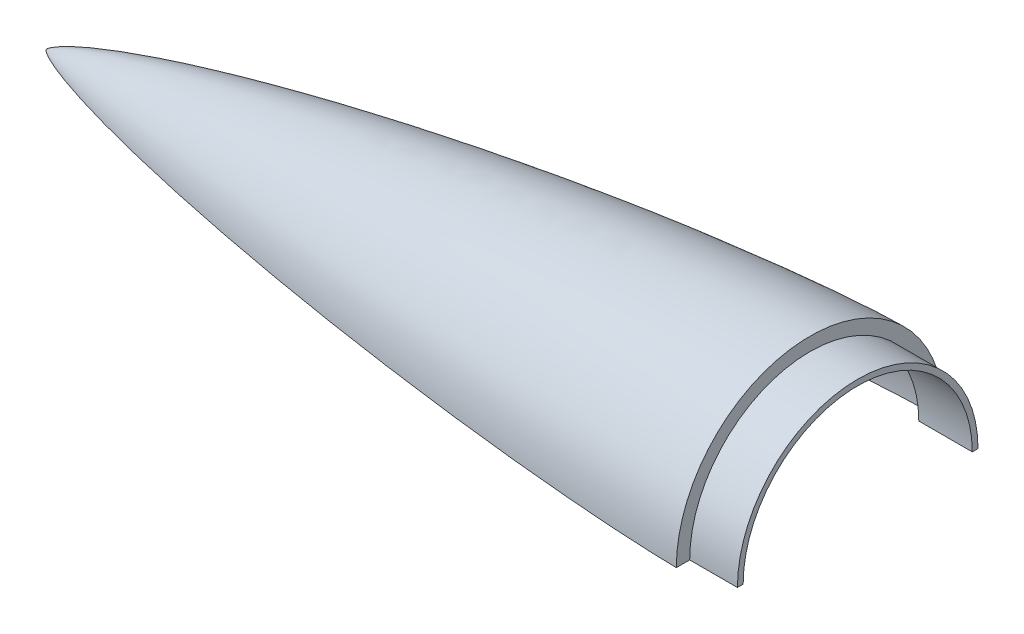
ISO-10303-21;
HEADER;
FILE_DESCRIPTION(('STEP AP214'),'2;1');
FILE_NAME('part.step','',(''),(''),'','','');
FILE_SCHEMA(('AUTOMOTIVE_DESIGN { 1 0 10303 214 1 1 1 1 }'));
ENDSEC;
DATA;
#1=APPLICATION_CONTEXT('core data for automotive mechanical design processes');
#2=APPLICATION_PROTOCOL_DEFINITION('international standard','automotive_design',2000,#1);
#3=PRODUCT_CONTEXT('',#1,'mechanical');
#4=PRODUCT('Part','Part','',(#3));
#5=PRODUCT_RELATED_PRODUCT_CATEGORY('part','',(#4));
#6=PRODUCT_DEFINITION_FORMATION('','',#4);
#7=PRODUCT_DEFINITION_CONTEXT('part definition',#1,'design');
#8=PRODUCT_DEFINITION('design','',#6,#7);
#9=PRODUCT_DEFINITION_SHAPE('','',#8);
#10=(LENGTH_UNIT() NAMED_UNIT(*) SI_UNIT(.MILLI.,.METRE.));
#11=(NAMED_UNIT(*) PLANE_ANGLE_UNIT() SI_UNIT($,.RADIAN.));
#12=(NAMED_UNIT(*) SI_UNIT($,.STERADIAN.) SOLID_ANGLE_UNIT());
#13=UNCERTAINTY_MEASURE_WITH_UNIT(LENGTH_MEASURE(1.E-05),#10,'distance_accuracy_value','');
#14=(GEOMETRIC_REPRESENTATION_CONTEXT(3) GLOBAL_UNCERTAINTY_ASSIGNED_CONTEXT((#13)) GLOBAL_UNIT_ASSIGNED_CONTEXT((#10,
#11,#12)) REPRESENTATION_CONTEXT('',''));
#15=CARTESIAN_POINT('',(0.,0.,0.));
#16=DIRECTION('',(0.,0.,1.));
#17=DIRECTION('',(1.,0.,0.));
#18=AXIS2_PLACEMENT_3D('',#15,#16,#17);
#19=CARTESIAN_POINT('',(0.,70.,0.));
#20=CARTESIAN_POINT('',(-1.16949961670868,69.995226326646,0.));
#21=CARTESIAN_POINT('',(-3.50827222437997,69.9582954923376,0.));
#22=CARTESIAN_POINT('',(-8.18492205701203,69.8427964931094,0.));
#23=CARTESIAN_POINT('',(-16.0647203077819,69.549683559367,0.));
#24=CARTESIAN_POINT('',(-25.9754545930025,69.0595655701343,0.));
#25=CARTESIAN_POINT('',(-41.1142995028447,68.1271885508895,0.));
#26=CARTESIAN_POINT('',(-60.3019712314636,66.6694611339765,0.));
#27=CARTESIAN_POINT('',(-82.6608105445907,64.6462274703062,0.));
#28=CARTESIAN_POINT('',(-108.176862675185,61.9592577213872,0.));
#29=CARTESIAN_POINT('',(-133.65506783508,58.9354318392771,0.));
#30=CARTESIAN_POINT('',(-159.093639283262,55.5950064524379,0.));
#31=CARTESIAN_POINT('',(-184.489927467141,51.9470200091218,0.));
#32=CARTESIAN_POINT('',(-209.840012518461,47.9907031560732,0.));
#33=CARTESIAN_POINT('',(-235.138543241406,43.7164840508938,0.));
#34=CARTESIAN_POINT('',(-260.377558213754,39.1034775288672,0.));
#35=CARTESIAN_POINT('',(-285.545859987468,34.1174005343544,0.));
#36=CARTESIAN_POINT('',(-310.625181375792,28.7002406264691,0.));
#37=CARTESIAN_POINT('',(-334.934852920424,22.9127414793634,0.));
#38=CARTESIAN_POINT('',(-355.97958419344,17.2897213562296,0.));
#39=CARTESIAN_POINT('',(-372.609649156935,12.2240751306481,0.));
#40=CARTESIAN_POINT('',(-384.103449660705,8.1599724038953,0.));
#41=CARTESIAN_POINT('',(-390.688387139325,5.4785191176599,0.));
#42=CARTESIAN_POINT('',(-394.221613408312,3.82269658501143,0.));
#43=CARTESIAN_POINT('',(-395.891479604764,2.94449609927367,0.));
#44=CARTESIAN_POINT('',(-396.471951593647,2.62151059680884,0.));
#45=B_SPLINE_CURVE_WITH_KNOTS('',4,(#19,#20,#21,#22,#23,#24,#25,#26,#27,#28,#29,#30,#31,#32,#33,
#34,#35,#36,#37,#38,#39,#40,#41,#42,#43,#44),.UNSPECIFIED.,.F.,.F.,(5,1,1,1,1,1,1,1,1,1,1,1,1,1,
1,1,1,1,1,1,1,1,5),(0.,0.0114632217312616,0.0229264434625231,0.0458528869250464,
0.0772877161212603,0.108722545317474,0.171592202654285,0.234461860835688,0.297331518792184,
0.360201174766281,0.423070831964841,0.485940492320326,0.548810146845117,0.611679804413118,
0.674549462980742,0.737419118438164,0.80028877075292,0.863158423951068,0.919463856187153,
0.950898668789713,0.970639035853759,0.98261611051617,0.989127343574552),.UNSPECIFIED.);
#46=CARTESIAN_POINT('',(-130.27278513866,0.,0.));
#47=DIRECTION('',(-1.,0.,0.));
#48=AXIS1_PLACEMENT('',#46,#47);
#49=SURFACE_OF_REVOLUTION('',#45,#48);
#50=OFFSET_SURFACE('',#49,-3.,.F.);
#51=CARTESIAN_POINT('',(-2.99999999999995,0.,66.9610434179468));
#52=CARTESIAN_POINT('',(-3.43888252484056,0.,66.952396026765));
#53=CARTESIAN_POINT('',(-3.87774772743526,0.,66.9429152196826));
#54=CARTESIAN_POINT('',(-4.75544268555462,0.,66.9224717190605));
#55=CARTESIAN_POINT('',(-5.19427244116037,0.,66.9115090290128));
#56=CARTESIAN_POINT('',(-6.51070158714471,0.,66.8766757176007));
#57=CARTESIAN_POINT('',(-7.38824970696645,0.,66.8508596731302));
#58=CARTESIAN_POINT('',(-9.14317888312383,0.,66.7948530243619));
#59=CARTESIAN_POINT('',(-10.0205599435967,0.,66.764662548097));
#60=CARTESIAN_POINT('',(-11.7751843774068,0.,66.7004628596125));
#61=CARTESIAN_POINT('',(-12.6524277503328,0.,66.6664536362003));
#62=CARTESIAN_POINT('',(-14.4064412794081,0.,66.5950682549035));
#63=CARTESIAN_POINT('',(-15.2832114882988,0.,66.5576933884347));
#64=CARTESIAN_POINT('',(-17.0366171320548,0.,66.4798996444132));
#65=CARTESIAN_POINT('',(-17.91325256679,0.,66.4394807639409));
#66=CARTESIAN_POINT('',(-20.5429708591908,0.,66.3139939412977));
#67=CARTESIAN_POINT('',(-22.2958530222071,0.,66.224696341354));
#68=CARTESIAN_POINT('',(-25.8008087555287,0.,66.0361401333468));
#69=CARTESIAN_POINT('',(-27.5528824085103,0.,65.9368830512253));
#70=CARTESIAN_POINT('',(-31.0564920504161,0.,65.7294122967442));
#71=CARTESIAN_POINT('',(-32.8080280412117,0.,65.6211986559247));
#72=CARTESIAN_POINT('',(-36.3104692811736,0.,65.3965704588788));
#73=CARTESIAN_POINT('',(-38.0613745614821,0.,65.280156387379));
#74=CARTESIAN_POINT('',(-41.5626631360219,0.,65.0397241907689));
#75=CARTESIAN_POINT('',(-43.3130464297218,0.,64.9157060579465));
#76=CARTESIAN_POINT('',(-48.5633498636771,0.,64.5329465634494));
#77=CARTESIAN_POINT('',(-52.062493241626,0.,64.2634955968156));
#78=CARTESIAN_POINT('',(-59.0587124582703,0.,63.6989380205588));
#79=CARTESIAN_POINT('',(-62.5557882886054,0.,63.4038313079005));
#80=CARTESIAN_POINT('',(-69.5474278512472,0.,62.7901579257159));
#81=CARTESIAN_POINT('',(-73.0419918475409,0.,62.4715942600364));
#82=CARTESIAN_POINT('',(-80.0292014442456,0.,61.8124786661117));
#83=CARTESIAN_POINT('',(-83.5218469510094,0.,61.471925746651));
#84=CARTESIAN_POINT('',(-90.5051906002409,0.,60.7700692376057));
#85=CARTESIAN_POINT('',(-93.9958886597688,0.,60.4087648235955));
#86=CARTESIAN_POINT('',(-100.975277186049,0.,59.6663561318406));
#87=CARTESIAN_POINT('',(-104.463967592976,0.,59.2852512921232));
#88=CARTESIAN_POINT('',(-111.439259958038,0.,58.5039965620865));
#89=CARTESIAN_POINT('',(-114.925861888631,0.,58.1038464259734));
#90=CARTESIAN_POINT('',(-121.896877308012,0.,57.2850921488217));
#91=CARTESIAN_POINT('',(-125.381290808534,0.,56.8664881076055));
#92=CARTESIAN_POINT('',(-133.35160350187,0.,55.8880486853035));
#93=CARTESIAN_POINT('',(-137.836774569437,0.,55.3222737582015));
#94=CARTESIAN_POINT('',(-146.803196621593,0.,54.1615245006798));
#95=CARTESIAN_POINT('',(-151.284447720027,0.,53.5665510489967));
#96=CARTESIAN_POINT('',(-160.242960539903,0.,52.3477841562707));
#97=CARTESIAN_POINT('',(-164.720222320264,0.,51.7239911483194));
#98=CARTESIAN_POINT('',(-173.670648464039,0.,50.4477088766467));
#99=CARTESIAN_POINT('',(-178.143812832296,0.,49.7952196468939));
#100=CARTESIAN_POINT('',(-187.085901760953,0.,48.4614170614654));
#101=CARTESIAN_POINT('',(-191.554826265871,0.,47.7801033337685));
#102=CARTESIAN_POINT('',(-200.488393631915,0.,46.388276988371));
#103=CARTESIAN_POINT('',(-204.953036228632,0.,45.6777626731107));
#104=CARTESIAN_POINT('',(-213.877525431171,0.,44.2269615141551));
#105=CARTESIAN_POINT('',(-218.337371992352,0.,43.4866743957551));
#106=CARTESIAN_POINT('',(-227.251845775793,0.,41.9754372468582));
#107=CARTESIAN_POINT('',(-231.706473025376,0.,41.204487377631));
#108=CARTESIAN_POINT('',(-240.610025267542,0.,39.6307014457303));
#109=CARTESIAN_POINT('',(-245.058950343966,0.,38.8278658575635));
#110=CARTESIAN_POINT('',(-253.950565128397,0.,37.1887457715759));
#111=CARTESIAN_POINT('',(-258.393254941974,0.,36.3524618473227));
#112=CARTESIAN_POINT('',(-265.626443186711,0.,34.9608650963703));
#113=CARTESIAN_POINT('',(-268.419011566216,0.,34.4162943709353));
#114=CARTESIAN_POINT('',(-274.001234772111,0.,33.3123962678183));
#115=CARTESIAN_POINT('',(-276.790889596647,0.,32.753068880752));
#116=CARTESIAN_POINT('',(-282.367055580555,0.,31.6188913426154));
#117=CARTESIAN_POINT('',(-285.153566726497,0.,31.0440411254912));
#118=CARTESIAN_POINT('',(-290.723145394243,0.,29.8778961934534));
#119=CARTESIAN_POINT('',(-293.506212919262,0.,29.2866014939128));
#120=CARTESIAN_POINT('',(-299.068277028093,0.,28.0865716504607));
#121=CARTESIAN_POINT('',(-301.847274014593,0.,27.4778383741989));
#122=CARTESIAN_POINT('',(-307.40109684245,0.,26.2415880230597));
#123=CARTESIAN_POINT('',(-310.17592267491,0.,25.6140709081794));
#124=CARTESIAN_POINT('',(-315.720814621765,0.,24.3386069943912));
#125=CARTESIAN_POINT('',(-318.490880839405,0.,23.6906606446934));
#126=CARTESIAN_POINT('',(-324.025663961762,0.,22.3723520418509));
#127=CARTESIAN_POINT('',(-326.790380903423,0.,21.7019899441058));
#128=CARTESIAN_POINT('',(-331.402332732126,0.,20.5616416957649));
#129=CARTESIAN_POINT('',(-333.251268926056,0.,20.0985312725594));
#130=CARTESIAN_POINT('',(-336.946047160374,0.,19.1601157310499));
#131=CARTESIAN_POINT('',(-338.791889201611,0.,18.6848106160909));
#132=CARTESIAN_POINT('',(-342.480112913489,0.,17.7208506634059));
#133=CARTESIAN_POINT('',(-344.322494538301,0.,17.2321956501874));
#134=CARTESIAN_POINT('',(-348.003251924485,0.,16.2402707702587));
#135=CARTESIAN_POINT('',(-349.841627828929,0.,15.73700143504));
#136=CARTESIAN_POINT('',(-353.513835545809,0.,14.7141906600207));
#137=CARTESIAN_POINT('',(-355.347667397896,0.,14.194649362754));
#138=CARTESIAN_POINT('',(-359.009897649795,0.,13.136877143322));
#139=CARTESIAN_POINT('',(-360.838296184148,0.,12.5986466882006));
#140=CARTESIAN_POINT('',(-364.038432714351,0.,11.6357257128484));
#141=CARTESIAN_POINT('',(-365.411594177994,0.,11.2157673062214));
#142=CARTESIAN_POINT('',(-368.153556358703,0.,10.3617812753048));
#143=CARTESIAN_POINT('',(-369.522357038444,0.,9.9277535309392));
#144=CARTESIAN_POINT('',(-372.254725978953,0.,9.04375144655052));
#145=CARTESIAN_POINT('',(-373.618294514137,0.,8.59377795587572));
#146=CARTESIAN_POINT('',(-376.338975622214,0.,7.67474112906591));
#147=CARTESIAN_POINT('',(-377.696088364248,0.,7.2056782961855));
#148=CARTESIAN_POINT('',(-379.728212285434,0.,6.48335297688492));
#149=CARTESIAN_POINT('',(-380.406372376539,0.,6.23893946698225));
#150=CARTESIAN_POINT('',(-381.760250160152,0.,5.74344551370973));
#151=CARTESIAN_POINT('',(-382.435967873165,0.,5.49236512646047));
#152=CARTESIAN_POINT('',(-383.784513196503,0.,4.98263399567667));
#153=CARTESIAN_POINT('',(-384.457340932011,0.,4.72398358392042));
#154=CARTESIAN_POINT('',(-385.799488681186,0.,4.19775854188566));
#155=CARTESIAN_POINT('',(-386.46880876229,0.,3.93018408391164));
#156=CARTESIAN_POINT('',(-387.805280407321,0.,3.38348890977298));
#157=CARTESIAN_POINT('',(-388.472417822326,0.,3.10433344709527));
#158=CARTESIAN_POINT('',(-389.468931324343,0.,2.67589675733894));
#159=CARTESIAN_POINT('',(-389.800397284897,0.,2.53147019539166));
#160=CARTESIAN_POINT('',(-390.461700490882,0.,2.23892115487399));
#161=CARTESIAN_POINT('',(-390.791537723327,0.,2.090798646889));
#162=CARTESIAN_POINT('',(-391.449954194621,0.,1.78995320958661));
#163=CARTESIAN_POINT('',(-391.77852930157,0.,1.63722121924235));
#164=CARTESIAN_POINT('',(-392.433279201752,0.,1.32670687858124));
#165=CARTESIAN_POINT('',(-392.759454047249,0.,1.1689246386325));
#166=CARTESIAN_POINT('',(-393.40923140082,0.,0.847245982483843));
#167=CARTESIAN_POINT('',(-393.732830723635,0.,0.683343100044987));
#168=CARTESIAN_POINT('',(-394.215368125964,0.,0.431821638446822));
#169=CARTESIAN_POINT('',(-394.375773130283,0.,0.347016707817738));
#170=CARTESIAN_POINT('',(-394.615518987886,0.,0.218176241518998));
#171=CARTESIAN_POINT('',(-394.695296896494,0.,0.174953782752291));
#172=CARTESIAN_POINT('',(-394.814727159502,0.,0.109682962325512));
#173=CARTESIAN_POINT('',(-394.854498743022,0.,0.0878526501471235));
#174=CARTESIAN_POINT('',(-394.914094010214,0.,0.0549939620825964));
#175=CARTESIAN_POINT('',(-394.933948875154,0.,0.0440221253171899));
#176=CARTESIAN_POINT('',(-394.963715263731,0.,0.0275355728031376));
#177=CARTESIAN_POINT('',(-394.973634758439,0.,0.0220352464710054));
#178=CARTESIAN_POINT('',(-394.988509974025,0.,0.0137774943274114));
#179=CARTESIAN_POINT('',(-394.993467710273,0.,0.0110236986531012));
#180=CARTESIAN_POINT('',(-395.000903301835,0.,0.00689118161342122));
#181=CARTESIAN_POINT('',(-395.003381663823,0.,0.00551337186225007));
#182=CARTESIAN_POINT('',(-395.007098952823,0.,0.00344620035921114));
#183=CARTESIAN_POINT('',(-395.00833800686,0.,0.00275706702657534));
#184=CARTESIAN_POINT('',(-395.010196524321,0.,0.00172325268483205));
#185=CARTESIAN_POINT('',(-395.010816019546,0.,0.00137862884479298));
#186=CARTESIAN_POINT('',(-395.011745246474,0.,0.000861664483472428));
#187=CARTESIAN_POINT('',(-395.012054986132,0.,0.000689338262503399));
#188=CARTESIAN_POINT('',(-395.012669620502,0.,0.000347368955913764));
#189=CARTESIAN_POINT('',(-395.012974515296,0.,0.00017772601813296));
#190=CARTESIAN_POINT('',(-395.013279407519,0.,8.07845877562677E-06));
#191=B_SPLINE_CURVE_WITH_KNOTS('',3,(#51,#52,#53,#54,#55,#56,#57,#58,#59,#60,#61,#62,#63,#64,
#65,#66,#67,#68,#69,#70,#71,#72,#73,#74,#75,#76,#77,#78,#79,#80,#81,#82,#83,#84,#85,#86,#87,#88,
#89,#90,#91,#92,#93,#94,#95,#96,#97,#98,#99,#100,#101,#102,#103,#104,#105,#106,#107,#108,#109,
#110,#111,#112,#113,#114,#115,#116,#117,#118,#119,#120,#121,#122,#123,#124,#125,#126,#127,#128,
#129,#130,#131,#132,#133,#134,#135,#136,#137,#138,#139,#140,#141,#142,#143,#144,#145,#146,#147,
#148,#149,#150,#151,#152,#153,#154,#155,#156,#157,#158,#159,#160,#161,#162,#163,#164,#165,#166,
#167,#168,#169,#170,#171,#172,#173,#174,#175,#176,#177,#178,#179,#180,#181,#182,#183,#184,#185,
#186,#187,#188,#189,#190),.UNSPECIFIED.,.F.,.F.,(4,2,2,2,2,2,2,2,2,2,2,2,2,2,2,2,2,2,2,2,2,2,2,
2,2,2,2,2,2,2,2,2,2,2,2,2,2,2,2,2,2,2,2,2,2,2,2,2,2,2,2,2,2,2,2,2,2,2,2,2,2,2,2,2,2,2,2,2,2,4),
(0.,1.31690091484604,2.63379872655486,5.26756779400745,7.9012597907728,10.5349595070443,
13.1676529293554,15.8003488766838,21.0657788515156,26.3304033118442,31.5950092337963,
36.8593042261299,42.1236045577084,52.6519957357815,63.1804291985594,73.7075167498442,
84.2350791652274,94.763060114424,105.29134003058,115.819755858886,126.348114742897,
139.910156459711,153.471790273635,167.033220353684,180.594634381105,194.156223491354,
207.718602115291,221.281105903911,234.843538370445,248.405769083432,261.967767332698,
270.503244460704,279.038727016752,287.574245899337,296.10975680289,304.644356956558,
313.178975287168,321.713406084218,330.247777727667,335.965899897551,341.684020498954,
347.402216304723,353.120204411845,358.838142446367,364.555937691783,368.863708523306,
373.17151612955,377.479094624804,381.786559632324,383.949111155919,386.111644481305,
388.27408316891,390.436480128531,392.60591533753,393.690590548364,394.775274394467,
395.862250633135,396.94920313323,398.037338386249,398.58165351003,398.853853825482,
398.989960361939,399.058014503681,399.092041688905,399.109055296147,399.117562101618,
399.121815504586,399.123942206099,399.12500555686,399.126052292765),.UNSPECIFIED.);
#192=CARTESIAN_POINT('',(-395.01326488884,0.,1.61569106375131E-05));
#193=VERTEX_POINT('',#192);
#194=CARTESIAN_POINT('',(-3.,0.,66.9610434179468));
#195=VERTEX_POINT('',#194);
#196=EDGE_CURVE('E103',#193,#195,#191,.F.);
#197=ORIENTED_EDGE('',*,*,#196,.F.);
#198=CARTESIAN_POINT('',(-2.99999999999995,0.,-66.9610434179468));
#199=CARTESIAN_POINT('',(-3.43888252484056,0.,-66.952396026765));
#200=CARTESIAN_POINT('',(-3.87774772743526,0.,-66.9429152196826));
#201=CARTESIAN_POINT('',(-4.75544268555462,0.,-66.9224717190605));
#202=CARTESIAN_POINT('',(-5.19427244116038,0.,-66.9115090290128));
#203=CARTESIAN_POINT('',(-6.51070158714471,0.,-66.8766757176007));
#204=CARTESIAN_POINT('',(-7.38824970696645,0.,-66.8508596731302));
#205=CARTESIAN_POINT('',(-9.14317888312383,0.,-66.7948530243619));
#206=CARTESIAN_POINT('',(-10.0205599435967,0.,-66.764662548097));
#207=CARTESIAN_POINT('',(-11.7751843774068,0.,-66.7004628596125));
#208=CARTESIAN_POINT('',(-12.6524277503328,0.,-66.6664536362003));
#209=CARTESIAN_POINT('',(-14.4064412794081,0.,-66.5950682549034));
#210=CARTESIAN_POINT('',(-15.2832114882988,0.,-66.5576933884347));
#211=CARTESIAN_POINT('',(-17.0366171320548,0.,-66.4798996444132));
#212=CARTESIAN_POINT('',(-17.91325256679,0.,-66.4394807639409));
#213=CARTESIAN_POINT('',(-20.5429708591908,0.,-66.3139939412977));
#214=CARTESIAN_POINT('',(-22.2958530222072,0.,-66.224696341354));
#215=CARTESIAN_POINT('',(-25.8008087555287,0.,-66.0361401333468));
#216=CARTESIAN_POINT('',(-27.5528824085104,0.,-65.9368830512253));
#217=CARTESIAN_POINT('',(-31.0564920504161,0.,-65.7294122967441));
#218=CARTESIAN_POINT('',(-32.8080280412117,0.,-65.6211986559247));
#219=CARTESIAN_POINT('',(-36.3104692811736,0.,-65.3965704588788));
#220=CARTESIAN_POINT('',(-38.0613745614822,0.,-65.280156387379));
#221=CARTESIAN_POINT('',(-41.5626631360219,0.,-65.0397241907689));
#222=CARTESIAN_POINT('',(-43.3130464297219,0.,-64.9157060579465));
#223=CARTESIAN_POINT('',(-48.5633498636771,0.,-64.5329465634493));
#224=CARTESIAN_POINT('',(-52.0624932416261,0.,-64.2634955968156));
#225=CARTESIAN_POINT('',(-59.0587124582703,0.,-63.6989380205588));
#226=CARTESIAN_POINT('',(-62.5557882886054,0.,-63.4038313079005));
#227=CARTESIAN_POINT('',(-69.5474278512473,0.,-62.7901579257159));
#228=CARTESIAN_POINT('',(-73.041991847541,0.,-62.4715942600363));
#229=CARTESIAN_POINT('',(-80.0292014442457,0.,-61.8124786661117));
#230=CARTESIAN_POINT('',(-83.5218469510095,0.,-61.471925746651));
#231=CARTESIAN_POINT('',(-90.5051906002409,0.,-60.7700692376057));
#232=CARTESIAN_POINT('',(-93.9958886597689,0.,-60.4087648235955));
#233=CARTESIAN_POINT('',(-100.975277186049,0.,-59.6663561318406));
#234=CARTESIAN_POINT('',(-104.463967592977,0.,-59.2852512921232));
#235=CARTESIAN_POINT('',(-111.439259958038,0.,-58.5039965620865));
#236=CARTESIAN_POINT('',(-114.925861888631,0.,-58.1038464259735));
#237=CARTESIAN_POINT('',(-121.896877308012,0.,-57.2850921488217));
#238=CARTESIAN_POINT('',(-125.381290808534,0.,-56.8664881076055));
#239=CARTESIAN_POINT('',(-133.35160350187,0.,-55.8880486853035));
#240=CARTESIAN_POINT('',(-137.836774569437,0.,-55.3222737582015));
#241=CARTESIAN_POINT('',(-146.803196621593,0.,-54.1615245006798));
#242=CARTESIAN_POINT('',(-151.284447720027,0.,-53.5665510489966));
#243=CARTESIAN_POINT('',(-160.242960539903,0.,-52.3477841562707));
#244=CARTESIAN_POINT('',(-164.720222320264,0.,-51.7239911483194));
#245=CARTESIAN_POINT('',(-173.670648464039,0.,-50.4477088766467));
#246=CARTESIAN_POINT('',(-178.143812832296,0.,-49.7952196468939));
#247=CARTESIAN_POINT('',(-187.085901760953,0.,-48.4614170614654));
#248=CARTESIAN_POINT('',(-191.554826265871,0.,-47.7801033337684));
#249=CARTESIAN_POINT('',(-200.488393631915,0.,-46.388276988371));
#250=CARTESIAN_POINT('',(-204.953036228632,0.,-45.6777626731107));
#251=CARTESIAN_POINT('',(-213.877525431171,0.,-44.2269615141551));
#252=CARTESIAN_POINT('',(-218.337371992353,0.,-43.486674395755));
#253=CARTESIAN_POINT('',(-227.251845775793,0.,-41.9754372468582));
#254=CARTESIAN_POINT('',(-231.706473025376,0.,-41.204487377631));
#255=CARTESIAN_POINT('',(-240.610025267542,0.,-39.6307014457302));
#256=CARTESIAN_POINT('',(-245.058950343967,0.,-38.8278658575635));
#257=CARTESIAN_POINT('',(-253.950565128397,0.,-37.1887457715759));
#258=CARTESIAN_POINT('',(-258.393254941974,0.,-36.3524618473226));
#259=CARTESIAN_POINT('',(-265.626443186711,0.,-34.9608650963703));
#260=CARTESIAN_POINT('',(-268.419011566217,0.,-34.4162943709354));
#261=CARTESIAN_POINT('',(-274.001234772111,0.,-33.3123962678183));
#262=CARTESIAN_POINT('',(-276.790889596647,0.,-32.753068880752));
#263=CARTESIAN_POINT('',(-282.367055580555,0.,-31.6188913426154));
#264=CARTESIAN_POINT('',(-285.153566726497,0.,-31.0440411254912));
#265=CARTESIAN_POINT('',(-290.723145394243,0.,-29.8778961934534));
#266=CARTESIAN_POINT('',(-293.506212919262,0.,-29.2866014939128));
#267=CARTESIAN_POINT('',(-299.068277028093,0.,-28.0865716504607));
#268=CARTESIAN_POINT('',(-301.847274014593,0.,-27.4778383741989));
#269=CARTESIAN_POINT('',(-307.40109684245,0.,-26.2415880230597));
#270=CARTESIAN_POINT('',(-310.175922674911,0.,-25.6140709081794));
#271=CARTESIAN_POINT('',(-315.720814621765,0.,-24.3386069943912));
#272=CARTESIAN_POINT('',(-318.490880839405,0.,-23.6906606446934));
#273=CARTESIAN_POINT('',(-324.025663961762,0.,-22.3723520418509));
#274=CARTESIAN_POINT('',(-326.790380903423,0.,-21.7019899441058));
#275=CARTESIAN_POINT('',(-331.402332732126,0.,-20.5616416957649));
#276=CARTESIAN_POINT('',(-333.251268926056,0.,-20.0985312725594));
#277=CARTESIAN_POINT('',(-336.946047160374,0.,-19.1601157310498));
#278=CARTESIAN_POINT('',(-338.791889201611,0.,-18.6848106160909));
#279=CARTESIAN_POINT('',(-342.480112913489,0.,-17.7208506634059));
#280=CARTESIAN_POINT('',(-344.322494538301,0.,-17.2321956501873));
#281=CARTESIAN_POINT('',(-348.003251924485,0.,-16.2402707702587));
#282=CARTESIAN_POINT('',(-349.841627828929,0.,-15.73700143504));
#283=CARTESIAN_POINT('',(-353.513835545809,0.,-14.7141906600207));
#284=CARTESIAN_POINT('',(-355.347667397896,0.,-14.194649362754));
#285=CARTESIAN_POINT('',(-359.009897649795,0.,-13.136877143322));
#286=CARTESIAN_POINT('',(-360.838296184148,0.,-12.5986466882006));
#287=CARTESIAN_POINT('',(-364.038432714351,0.,-11.6357257128484));
#288=CARTESIAN_POINT('',(-365.411594177994,0.,-11.2157673062214));
#289=CARTESIAN_POINT('',(-368.153556358703,0.,-10.3617812753048));
#290=CARTESIAN_POINT('',(-369.522357038444,0.,-9.92775353093919));
#291=CARTESIAN_POINT('',(-372.254725978953,0.,-9.0437514465505));
#292=CARTESIAN_POINT('',(-373.618294514137,0.,-8.59377795587572));
#293=CARTESIAN_POINT('',(-376.338975622214,0.,-7.67474112906591));
#294=CARTESIAN_POINT('',(-377.696088364248,0.,-7.20567829618549));
#295=CARTESIAN_POINT('',(-379.728212285434,0.,-6.48335297688492));
#296=CARTESIAN_POINT('',(-380.406372376539,0.,-6.23893946698225));
#297=CARTESIAN_POINT('',(-381.760250160152,0.,-5.74344551370973));
#298=CARTESIAN_POINT('',(-382.435967873165,0.,-5.49236512646047));
#299=CARTESIAN_POINT('',(-383.784513196503,0.,-4.98263399567665));
#300=CARTESIAN_POINT('',(-384.457340932011,0.,-4.72398358392038));
#301=CARTESIAN_POINT('',(-385.799488681186,0.,-4.1977585418856));
#302=CARTESIAN_POINT('',(-386.46880876229,0.,-3.9301840839116));
#303=CARTESIAN_POINT('',(-387.805280407321,0.,-3.38348890977295));
#304=CARTESIAN_POINT('',(-388.472417822326,0.,-3.10433344709523));
#305=CARTESIAN_POINT('',(-389.468931324343,0.,-2.67589675733896));
#306=CARTESIAN_POINT('',(-389.800397284897,0.,-2.5314701953917));
#307=CARTESIAN_POINT('',(-390.461700490882,0.,-2.23892115487403));
#308=CARTESIAN_POINT('',(-390.791537723327,0.,-2.09079864688901));
#309=CARTESIAN_POINT('',(-391.449954194621,0.,-1.78995320958656));
#310=CARTESIAN_POINT('',(-391.77852930157,0.,-1.63722121924228));
#311=CARTESIAN_POINT('',(-392.433279201752,0.,-1.32670687858116));
#312=CARTESIAN_POINT('',(-392.759454047249,0.,-1.16892463863245));
#313=CARTESIAN_POINT('',(-393.40923140082,0.,-0.8472459824838));
#314=CARTESIAN_POINT('',(-393.732830723635,0.,-0.683343100044926));
#315=CARTESIAN_POINT('',(-394.215368125965,0.,-0.431821638446744));
#316=CARTESIAN_POINT('',(-394.375773130283,0.,-0.34701670781769));
#317=CARTESIAN_POINT('',(-394.615518987886,0.,-0.218176241518941));
#318=CARTESIAN_POINT('',(-394.695296896494,0.,-0.174953782752167));
#319=CARTESIAN_POINT('',(-394.814727159502,0.,-0.109682962325282));
#320=CARTESIAN_POINT('',(-394.854498743023,0.,-0.0878526501468923));
#321=CARTESIAN_POINT('',(-394.914094010214,0.,-0.0549939620824346));
#322=CARTESIAN_POINT('',(-394.933948875154,0.,-0.044022125317069));
#323=CARTESIAN_POINT('',(-394.963715263731,0.,-0.0275355728030031));
#324=CARTESIAN_POINT('',(-394.973634758439,0.,-0.0220352464708097));
#325=CARTESIAN_POINT('',(-394.988509974026,0.,-0.0137774943272939));
#326=CARTESIAN_POINT('',(-394.993467710273,0.,-0.0110236986531026));
#327=CARTESIAN_POINT('',(-395.000903301835,0.,-0.00689118161343139));
#328=CARTESIAN_POINT('',(-395.003381663823,0.,-0.00551337186221626));
#329=CARTESIAN_POINT('',(-395.007098952823,0.,-0.00344620035919115));
#330=CARTESIAN_POINT('',(-395.008338006859,0.,-0.00275706702660101));
#331=CARTESIAN_POINT('',(-395.010196524321,0.,-0.00172325268485671));
#332=CARTESIAN_POINT('',(-395.010816019546,0.,-0.00137862884475159));
#333=CARTESIAN_POINT('',(-395.011745246474,0.,-0.000861664483406283));
#334=CARTESIAN_POINT('',(-395.012054986132,0.,-0.00068933826247278));
#335=CARTESIAN_POINT('',(-395.012669620502,0.,-0.000347368955920691));
#336=CARTESIAN_POINT('',(-395.012974515296,0.,-0.000177726018142059));
#337=CARTESIAN_POINT('',(-395.013279407519,0.,-8.07845877562677E-06));
#338=B_SPLINE_CURVE_WITH_KNOTS('',3,(#198,#199,#200,#201,#202,#203,#204,#205,#206,#207,#208,
#209,#210,#211,#212,#213,#214,#215,#216,#217,#218,#219,#220,#221,#222,#223,#224,#225,#226,#227,
#228,#229,#230,#231,#232,#233,#234,#235,#236,#237,#238,#239,#240,#241,#242,#243,#244,#245,#246,
#247,#248,#249,#250,#251,#252,#253,#254,#255,#256,#257,#258,#259,#260,#261,#262,#263,#264,#265,
#266,#267,#268,#269,#270,#271,#272,#273,#274,#275,#276,#277,#278,#279,#280,#281,#282,#283,#284,
#285,#286,#287,#288,#289,#290,#291,#292,#293,#294,#295,#296,#297,#298,#299,#300,#301,#302,#303,
#304,#305,#306,#307,#308,#309,#310,#311,#312,#313,#314,#315,#316,#317,#318,#319,#320,#321,#322,
#323,#324,#325,#326,#327,#328,#329,#330,#331,#332,#333,#334,#335,#336,#337),.UNSPECIFIED.,.F.,
.F.,(4,2,2,2,2,2,2,2,2,2,2,2,2,2,2,2,2,2,2,2,2,2,2,2,2,2,2,2,2,2,2,2,2,2,2,2,2,2,2,2,2,2,2,2,2,
2,2,2,2,2,2,2,2,2,2,2,2,2,2,2,2,2,2,2,2,2,2,2,2,4),(0.,1.31690091484604,2.63379872655486,
5.26756779400746,7.90125979077281,10.5349595070443,13.1676529293554,15.8003488766838,
21.0657788515156,26.3304033118442,31.5950092337963,36.85930422613,42.1236045577084,
52.6519957357815,63.1804291985594,73.7075167498442,84.2350791652274,94.763060114424,
105.29134003058,115.819755858886,126.348114742897,139.910156459711,153.471790273635,
167.033220353685,180.594634381105,194.156223491354,207.718602115291,221.281105903911,
234.843538370445,248.405769083432,261.967767332698,270.503244460704,279.038727016752,
287.574245899337,296.10975680289,304.644356956559,313.178975287169,321.713406084218,
330.247777727667,335.965899897552,341.684020498954,347.402216304723,353.120204411845,
358.838142446367,364.555937691783,368.863708523306,373.171516129549,377.479094624804,
381.786559632324,383.949111155919,386.111644481304,388.27408316891,390.436480128531,
392.60591533753,393.690590548364,394.775274394466,395.862250633135,396.94920313323,
398.037338386249,398.58165351003,398.853853825483,398.98996036194,399.058014503681,
399.092041688906,399.109055296147,399.117562101618,399.121815504586,399.1239422061,
399.12500555686,399.126052292765),.UNSPECIFIED.);
#339=CARTESIAN_POINT('',(-3.,0.,-66.9610434179468));
#340=VERTEX_POINT('',#339);
#341=EDGE_CURVE('E61',#340,#193,#338,.T.);
#342=ORIENTED_EDGE('',*,*,#341,.F.);
#343=CARTESIAN_POINT('',(-2.99999999999995,0.,0.));
#344=DIRECTION('',(-1.,0.,0.));
#345=DIRECTION('',(0.,0.,1.));
#346=AXIS2_PLACEMENT_3D('',#343,#344,#345);
#347=CIRCLE('',#346,66.9610434179468);
#348=EDGE_CURVE('E102',#195,#340,#347,.T.);
#349=ORIENTED_EDGE('',*,*,#348,.F.);
#350=EDGE_LOOP('',(#197,#342,#349));
#351=FACE_BOUND('',#350,.T.);
#352=ADVANCED_FACE('F33',(#351),#50,.F.);
#353=CARTESIAN_POINT('',(25.,0.,0.));
#354=DIRECTION('',(1.,0.,0.));
#355=DIRECTION('',(0.,0.,-1.));
#356=AXIS2_PLACEMENT_3D('',#353,#354,#355);
#357=PLANE('',#356);
#358=DIRECTION('',(0.,0.,1.));
#359=VECTOR('',#358,1.);
#360=CARTESIAN_POINT('',(25.,0.,0.));
#361=LINE('',#360,#359);
#362=CARTESIAN_POINT('',(25.,0.,-63.));
#363=VERTEX_POINT('',#362);
#364=CARTESIAN_POINT('',(25.,0.,-60.));
#365=VERTEX_POINT('',#364);
#366=EDGE_CURVE('E153',#363,#365,#361,.T.);
#367=ORIENTED_EDGE('',*,*,#366,.F.);
#368=CARTESIAN_POINT('',(25.,0.,0.));
#369=DIRECTION('',(1.,0.,0.));
#370=DIRECTION('',(0.,0.,-1.));
#371=AXIS2_PLACEMENT_3D('',#368,#369,#370);
#372=CIRCLE('',#371,63.);
#373=CARTESIAN_POINT('',(25.,0.,63.));
#374=VERTEX_POINT('',#373);
#375=EDGE_CURVE('E99',#363,#374,#372,.T.);
#376=ORIENTED_EDGE('',*,*,#375,.T.);
#377=CARTESIAN_POINT('',(25.,0.,60.));
#378=VERTEX_POINT('',#377);
#379=EDGE_CURVE('E160',#378,#374,#361,.T.);
#380=ORIENTED_EDGE('',*,*,#379,.F.);
#381=CARTESIAN_POINT('',(25.,0.,0.));
#382=DIRECTION('',(1.,0.,0.));
#383=DIRECTION('',(0.,0.,-1.));
#384=AXIS2_PLACEMENT_3D('',#381,#382,#383);
#385=CIRCLE('',#384,60.);
#386=EDGE_CURVE('E157',#365,#378,#385,.T.);
#387=ORIENTED_EDGE('',*,*,#386,.F.);
#388=EDGE_LOOP('',(#367,#376,#380,#387));
#389=FACE_BOUND('',#388,.T.);
#390=ADVANCED_FACE('F142',(#389),#357,.T.);
#391=CARTESIAN_POINT('',(25.,0.,0.));
#392=DIRECTION('',(-1.,0.,0.));
#393=DIRECTION('',(0.,0.,1.));
#394=AXIS2_PLACEMENT_3D('',#391,#392,#393);
#395=CYLINDRICAL_SURFACE('',#394,63.);
#396=ORIENTED_EDGE('',*,*,#375,.F.);
#397=DIRECTION('',(-1.,0.,0.));
#398=VECTOR('',#397,1.);
#399=CARTESIAN_POINT('',(25.,0.,-63.));
#400=LINE('',#399,#398);
#401=CARTESIAN_POINT('',(0.,0.,-63.));
#402=VERTEX_POINT('',#401);
#403=EDGE_CURVE('E158',#363,#402,#400,.T.);
#404=ORIENTED_EDGE('',*,*,#403,.T.);
#405=CARTESIAN_POINT('',(0.,0.,0.));
#406=DIRECTION('',(-1.,0.,0.));
#407=DIRECTION('',(0.,0.,1.));
#408=AXIS2_PLACEMENT_3D('',#405,#406,#407);
#409=CIRCLE('',#408,63.);
#410=CARTESIAN_POINT('',(0.,0.,63.));
#411=VERTEX_POINT('',#410);
#412=EDGE_CURVE('E167',#411,#402,#409,.T.);
#413=ORIENTED_EDGE('',*,*,#412,.F.);
#414=DIRECTION('',(-1.,0.,0.));
#415=VECTOR('',#414,1.);
#416=CARTESIAN_POINT('',(25.,0.,63.));
#417=LINE('',#416,#415);
#418=EDGE_CURVE('E165',#411,#374,#417,.F.);
#419=ORIENTED_EDGE('',*,*,#418,.T.);
#420=EDGE_LOOP('',(#396,#404,#413,#419));
#421=FACE_BOUND('',#420,.T.);
#422=ADVANCED_FACE('F35',(#421),#395,.T.);
#423=CARTESIAN_POINT('',(25.,0.,0.));
#424=DIRECTION('',(-1.,0.,0.));
#425=DIRECTION('',(0.,0.,1.));
#426=AXIS2_PLACEMENT_3D('',#423,#424,#425);
#427=CYLINDRICAL_SURFACE('',#426,60.);
#428=DIRECTION('',(-1.,0.,0.));
#429=VECTOR('',#428,1.);
#430=CARTESIAN_POINT('',(25.,0.,-60.));
#431=LINE('',#430,#429);
#432=CARTESIAN_POINT('',(-3.,0.,-60.));
#433=VERTEX_POINT('',#432);
#434=EDGE_CURVE('E55',#365,#433,#431,.T.);
#435=ORIENTED_EDGE('',*,*,#434,.F.);
#436=ORIENTED_EDGE('',*,*,#386,.T.);
#437=DIRECTION('',(-1.,0.,0.));
#438=VECTOR('',#437,1.);
#439=CARTESIAN_POINT('',(25.,0.,60.));
#440=LINE('',#439,#438);
#441=CARTESIAN_POINT('',(-3.,0.,60.));
#442=VERTEX_POINT('',#441);
#443=EDGE_CURVE('E111',#442,#378,#440,.F.);
#444=ORIENTED_EDGE('',*,*,#443,.F.);
#445=CARTESIAN_POINT('',(-3.,0.,0.));
#446=DIRECTION('',(-1.,0.,0.));
#447=DIRECTION('',(0.,0.,1.));
#448=AXIS2_PLACEMENT_3D('',#445,#446,#447);
#449=CIRCLE('',#448,60.);
#450=EDGE_CURVE('E107',#442,#433,#449,.T.);
#451=ORIENTED_EDGE('',*,*,#450,.T.);
#452=EDGE_LOOP('',(#435,#436,#444,#451));
#453=FACE_BOUND('',#452,.T.);
#454=ADVANCED_FACE('F138',(#453),#427,.F.);
#455=CARTESIAN_POINT('',(0.,70.,0.));
#456=CARTESIAN_POINT('',(-1.16949961670868,69.995226326646,0.));
#457=CARTESIAN_POINT('',(-3.50827222437997,69.9582954923376,0.));
#458=CARTESIAN_POINT('',(-8.18492205701203,69.8427964931094,0.));
#459=CARTESIAN_POINT('',(-16.0647203077819,69.549683559367,0.));
#460=CARTESIAN_POINT('',(-25.9754545930025,69.0595655701343,0.));
#461=CARTESIAN_POINT('',(-41.1142995028447,68.1271885508895,0.));
#462=CARTESIAN_POINT('',(-60.3019712314636,66.6694611339765,0.));
#463=CARTESIAN_POINT('',(-82.6608105445907,64.6462274703062,0.));
#464=CARTESIAN_POINT('',(-108.176862675185,61.9592577213872,0.));
#465=CARTESIAN_POINT('',(-133.65506783508,58.9354318392771,0.));
#466=CARTESIAN_POINT('',(-159.093639283262,55.5950064524379,0.));
#467=CARTESIAN_POINT('',(-184.489927467141,51.9470200091218,0.));
#468=CARTESIAN_POINT('',(-209.840012518461,47.9907031560732,0.));
#469=CARTESIAN_POINT('',(-235.138543241406,43.7164840508938,0.));
#470=CARTESIAN_POINT('',(-260.377558213754,39.1034775288672,0.));
#471=CARTESIAN_POINT('',(-285.545859987468,34.1174005343544,0.));
#472=CARTESIAN_POINT('',(-310.625181375792,28.7002406264691,0.));
#473=CARTESIAN_POINT('',(-334.934852920424,22.9127414793634,0.));
#474=CARTESIAN_POINT('',(-355.97958419344,17.2897213562296,0.));
#475=CARTESIAN_POINT('',(-372.609649156935,12.2240751306481,0.));
#476=CARTESIAN_POINT('',(-384.103449660705,8.1599724038953,0.));
#477=CARTESIAN_POINT('',(-390.7239120744,5.4640530040166,0.));
#478=CARTESIAN_POINT('',(-394.652214817555,3.62065358072402,0.));
#479=CARTESIAN_POINT('',(-396.907481639524,2.40078788729424,0.));
#480=CARTESIAN_POINT('',(-398.171176016375,1.61804815935371,0.));
#481=CARTESIAN_POINT('',(-398.88761474139,1.11373766567203,0.));
#482=CARTESIAN_POINT('',(-399.307469567689,0.780093426265872,0.));
#483=CARTESIAN_POINT('',(-399.551614216444,0.562371791642685,0.));
#484=CARTESIAN_POINT('',(-399.702529388175,0.412956359416617,0.));
#485=CARTESIAN_POINT('',(-399.808974183387,0.296826108822494,0.));
#486=CARTESIAN_POINT('',(-399.883555871322,0.20624010639082,0.));
#487=CARTESIAN_POINT('',(-399.939612976076,0.127603534508944,0.));
#488=CARTESIAN_POINT('',(-399.977285927328,0.061984402420316,0.));
#489=CARTESIAN_POINT('',(-399.992792134037,0.0274035455705753,0.));
#490=CARTESIAN_POINT('',(-399.998003390164,0.00927022077294986,0.));
#491=CARTESIAN_POINT('',(-400.,0.,0.));
#492=B_SPLINE_CURVE_WITH_KNOTS('',4,(#455,#456,#457,#458,#459,#460,#461,#462,#463,#464,#465,
#466,#467,#468,#469,#470,#471,#472,#473,#474,#475,#476,#477,#478,#479,#480,#481,#482,#483,#484,
#485,#486,#487,#488,#489,#490,#491),.UNSPECIFIED.,.F.,.F.,(5,1,1,1,1,1,1,1,1,1,1,1,1,1,1,1,1,1,
1,1,1,1,1,1,1,1,1,1,1,1,1,1,1,5),(0.,0.0114632217312616,0.0229264434625231,0.0458528869250464,
0.0772877161212603,0.108722545317474,0.171592202654285,0.234461860835688,0.297331518792184,
0.360201174766281,0.423070831964841,0.485940492320326,0.548810146845117,0.611679804413118,
0.674549462980742,0.737419118438164,0.80028877075292,0.863158423951068,0.919463856187153,
0.950898668789713,0.970639035853759,0.98261611051617,0.989503169597891,0.993411480874269,
0.995757601440822,0.997178485660021,0.998086075258459,0.998665321853755,0.998962318374674,
0.999259314895592,0.999629657447796,0.999814828723898,0.999907414361949,1.),.UNSPECIFIED.);
#493=CARTESIAN_POINT('',(-130.27278513866,0.,0.));
#494=DIRECTION('',(-1.,0.,0.));
#495=AXIS1_PLACEMENT('',#493,#494);
#496=SURFACE_OF_REVOLUTION('',#492,#495);
#497=CARTESIAN_POINT('',(0.,0.,0.));
#498=DIRECTION('',(-1.,0.,0.));
#499=DIRECTION('',(0.,0.,1.));
#500=AXIS2_PLACEMENT_3D('',#497,#498,#499);
#501=CIRCLE('',#500,70.);
#502=CARTESIAN_POINT('',(0.,0.,70.));
#503=VERTEX_POINT('',#502);
#504=CARTESIAN_POINT('',(0.,0.,-70.));
#505=VERTEX_POINT('',#504);
#506=EDGE_CURVE('E109',#503,#505,#501,.T.);
#507=ORIENTED_EDGE('',*,*,#506,.T.);
#508=CARTESIAN_POINT('',(0.,0.,-70.));
#509=CARTESIAN_POINT('',(-1.16949961670868,0.,-69.995226326646));
#510=CARTESIAN_POINT('',(-3.50827222437997,0.,-69.9582954923376));
#511=CARTESIAN_POINT('',(-8.18492205701203,0.,-69.8427964931094));
#512=CARTESIAN_POINT('',(-16.0647203077819,0.,-69.549683559367));
#513=CARTESIAN_POINT('',(-25.9754545930025,0.,-69.0595655701343));
#514=CARTESIAN_POINT('',(-41.1142995028447,0.,-68.1271885508895));
#515=CARTESIAN_POINT('',(-60.3019712314636,0.,-66.6694611339765));
#516=CARTESIAN_POINT('',(-82.6608105445907,0.,-64.6462274703062));
#517=CARTESIAN_POINT('',(-108.176862675185,0.,-61.9592577213872));
#518=CARTESIAN_POINT('',(-133.65506783508,0.,-58.9354318392771));
#519=CARTESIAN_POINT('',(-159.093639283262,0.,-55.5950064524379));
#520=CARTESIAN_POINT('',(-184.489927467141,0.,-51.9470200091218));
#521=CARTESIAN_POINT('',(-209.840012518461,0.,-47.9907031560732));
#522=CARTESIAN_POINT('',(-235.138543241406,0.,-43.7164840508938));
#523=CARTESIAN_POINT('',(-260.377558213754,0.,-39.1034775288672));
#524=CARTESIAN_POINT('',(-285.545859987468,0.,-34.1174005343544));
#525=CARTESIAN_POINT('',(-310.625181375792,0.,-28.7002406264691));
#526=CARTESIAN_POINT('',(-334.934852920424,0.,-22.9127414793634));
#527=CARTESIAN_POINT('',(-355.97958419344,0.,-17.2897213562296));
#528=CARTESIAN_POINT('',(-372.609649156935,0.,-12.2240751306481));
#529=CARTESIAN_POINT('',(-384.103449660705,0.,-8.1599724038953));
#530=CARTESIAN_POINT('',(-390.7239120744,0.,-5.4640530040166));
#531=CARTESIAN_POINT('',(-394.652214817555,0.,-3.62065358072402));
#532=CARTESIAN_POINT('',(-396.907481639524,0.,-2.40078788729424));
#533=CARTESIAN_POINT('',(-398.171176016375,0.,-1.61804815935371));
#534=CARTESIAN_POINT('',(-398.88761474139,0.,-1.11373766567203));
#535=CARTESIAN_POINT('',(-399.307469567689,0.,-0.780093426265872));
#536=CARTESIAN_POINT('',(-399.551614216444,0.,-0.562371791642685));
#537=CARTESIAN_POINT('',(-399.702529388175,0.,-0.412956359416617));
#538=CARTESIAN_POINT('',(-399.808974183387,0.,-0.296826108822494));
#539=CARTESIAN_POINT('',(-399.883555871322,0.,-0.20624010639082));
#540=CARTESIAN_POINT('',(-399.939612976076,0.,-0.127603534508944));
#541=CARTESIAN_POINT('',(-399.977285927328,0.,-0.061984402420316));
#542=CARTESIAN_POINT('',(-399.992792134037,0.,-0.0274035455705753));
#543=CARTESIAN_POINT('',(-399.998003390164,0.,-0.00927022077294986));
#544=CARTESIAN_POINT('',(-400.,0.,0.));
#545=B_SPLINE_CURVE_WITH_KNOTS('',4,(#508,#509,#510,#511,#512,#513,#514,#515,#516,#517,#518,
#519,#520,#521,#522,#523,#524,#525,#526,#527,#528,#529,#530,#531,#532,#533,#534,#535,#536,#537,
#538,#539,#540,#541,#542,#543,#544),.UNSPECIFIED.,.F.,.F.,(5,1,1,1,1,1,1,1,1,1,1,1,1,1,1,1,1,1,
1,1,1,1,1,1,1,1,1,1,1,1,1,1,1,5),(0.,0.0114632217312616,0.0229264434625231,0.0458528869250464,
0.0772877161212603,0.108722545317474,0.171592202654285,0.234461860835688,0.297331518792184,
0.360201174766281,0.423070831964841,0.485940492320326,0.548810146845117,0.611679804413118,
0.674549462980742,0.737419118438164,0.80028877075292,0.863158423951068,0.919463856187153,
0.950898668789713,0.970639035853759,0.98261611051617,0.989503169597891,0.993411480874269,
0.995757601440822,0.997178485660021,0.998086075258459,0.998665321853755,0.998962318374674,
0.999259314895592,0.999629657447796,0.999814828723898,0.999907414361949,1.),.UNSPECIFIED.);
#546=CARTESIAN_POINT('',(-400.,0.,0.));
#547=VERTEX_POINT('',#546);
#548=EDGE_CURVE('E174',#505,#547,#545,.T.);
#549=ORIENTED_EDGE('',*,*,#548,.T.);
#550=CARTESIAN_POINT('',(0.,0.,70.));
#551=CARTESIAN_POINT('',(-1.16949961670868,0.,69.995226326646));
#552=CARTESIAN_POINT('',(-3.50827222437997,0.,69.9582954923376));
#553=CARTESIAN_POINT('',(-8.18492205701203,0.,69.8427964931094));
#554=CARTESIAN_POINT('',(-16.0647203077819,0.,69.549683559367));
#555=CARTESIAN_POINT('',(-25.9754545930025,0.,69.0595655701343));
#556=CARTESIAN_POINT('',(-41.1142995028447,0.,68.1271885508895));
#557=CARTESIAN_POINT('',(-60.3019712314636,0.,66.6694611339765));
#558=CARTESIAN_POINT('',(-82.6608105445907,0.,64.6462274703062));
#559=CARTESIAN_POINT('',(-108.176862675185,0.,61.9592577213872));
#560=CARTESIAN_POINT('',(-133.65506783508,0.,58.9354318392771));
#561=CARTESIAN_POINT('',(-159.093639283262,0.,55.5950064524379));
#562=CARTESIAN_POINT('',(-184.489927467141,0.,51.9470200091218));
#563=CARTESIAN_POINT('',(-209.840012518461,0.,47.9907031560732));
#564=CARTESIAN_POINT('',(-235.138543241406,0.,43.7164840508938));
#565=CARTESIAN_POINT('',(-260.377558213754,0.,39.1034775288672));
#566=CARTESIAN_POINT('',(-285.545859987468,0.,34.1174005343544));
#567=CARTESIAN_POINT('',(-310.625181375792,0.,28.7002406264691));
#568=CARTESIAN_POINT('',(-334.934852920424,0.,22.9127414793634));
#569=CARTESIAN_POINT('',(-355.97958419344,0.,17.2897213562296));
#570=CARTESIAN_POINT('',(-372.609649156935,0.,12.2240751306481));
#571=CARTESIAN_POINT('',(-384.103449660705,0.,8.1599724038953));
#572=CARTESIAN_POINT('',(-390.7239120744,0.,5.4640530040166));
#573=CARTESIAN_POINT('',(-394.652214817555,0.,3.62065358072402));
#574=CARTESIAN_POINT('',(-396.907481639524,0.,2.40078788729424));
#575=CARTESIAN_POINT('',(-398.171176016375,0.,1.61804815935371));
#576=CARTESIAN_POINT('',(-398.88761474139,0.,1.11373766567203));
#577=CARTESIAN_POINT('',(-399.307469567689,0.,0.780093426265872));
#578=CARTESIAN_POINT('',(-399.551614216444,0.,0.562371791642685));
#579=CARTESIAN_POINT('',(-399.702529388175,0.,0.412956359416617));
#580=CARTESIAN_POINT('',(-399.808974183387,0.,0.296826108822494));
#581=CARTESIAN_POINT('',(-399.883555871322,0.,0.20624010639082));
#582=CARTESIAN_POINT('',(-399.939612976076,0.,0.127603534508944));
#583=CARTESIAN_POINT('',(-399.977285927328,0.,0.061984402420316));
#584=CARTESIAN_POINT('',(-399.992792134037,0.,0.0274035455705753));
#585=CARTESIAN_POINT('',(-399.998003390164,0.,0.00927022077294986));
#586=CARTESIAN_POINT('',(-400.,0.,0.));
#587=B_SPLINE_CURVE_WITH_KNOTS('',4,(#550,#551,#552,#553,#554,#555,#556,#557,#558,#559,#560,
#561,#562,#563,#564,#565,#566,#567,#568,#569,#570,#571,#572,#573,#574,#575,#576,#577,#578,#579,
#580,#581,#582,#583,#584,#585,#586),.UNSPECIFIED.,.F.,.F.,(5,1,1,1,1,1,1,1,1,1,1,1,1,1,1,1,1,1,
1,1,1,1,1,1,1,1,1,1,1,1,1,1,1,5),(0.,0.0114632217312616,0.0229264434625231,0.0458528869250464,
0.0772877161212603,0.108722545317474,0.171592202654285,0.234461860835688,0.297331518792184,
0.360201174766281,0.423070831964841,0.485940492320326,0.548810146845117,0.611679804413118,
0.674549462980742,0.737419118438164,0.80028877075292,0.863158423951068,0.919463856187153,
0.950898668789713,0.970639035853759,0.98261611051617,0.989503169597891,0.993411480874269,
0.995757601440822,0.997178485660021,0.998086075258459,0.998665321853755,0.998962318374674,
0.999259314895592,0.999629657447796,0.999814828723898,0.999907414361949,1.),.UNSPECIFIED.);
#588=EDGE_CURVE('E175',#547,#503,#587,.F.);
#589=ORIENTED_EDGE('',*,*,#588,.T.);
#590=EDGE_LOOP('',(#507,#549,#589));
#591=FACE_BOUND('',#590,.T.);
#592=ADVANCED_FACE('F134',(#591),#496,.T.);
#593=CARTESIAN_POINT('',(0.,70.,0.));
#594=DIRECTION('',(-1.,0.,0.));
#595=DIRECTION('',(0.,0.,1.));
#596=AXIS2_PLACEMENT_3D('',#593,#594,#595);
#597=PLANE('',#596);
#598=ORIENTED_EDGE('',*,*,#506,.F.);
#599=DIRECTION('',(0.,0.,-1.));
#600=VECTOR('',#599,1.);
#601=CARTESIAN_POINT('',(0.,0.,0.));
#602=LINE('',#601,#600);
#603=EDGE_CURVE('E178',#503,#411,#602,.T.);
#604=ORIENTED_EDGE('',*,*,#603,.T.);
#605=ORIENTED_EDGE('',*,*,#412,.T.);
#606=EDGE_CURVE('E179',#402,#505,#602,.T.);
#607=ORIENTED_EDGE('',*,*,#606,.T.);
#608=EDGE_LOOP('',(#598,#604,#605,#607));
#609=FACE_BOUND('',#608,.T.);
#610=ADVANCED_FACE('F131',(#609),#597,.F.);
#611=CARTESIAN_POINT('',(-3.,70.,0.));
#612=DIRECTION('',(-1.,0.,0.));
#613=DIRECTION('',(0.,0.,1.));
#614=AXIS2_PLACEMENT_3D('',#611,#612,#613);
#615=PLANE('',#614);
#616=DIRECTION('',(0.,0.,-1.));
#617=VECTOR('',#616,1.);
#618=CARTESIAN_POINT('',(-3.,0.,0.));
#619=LINE('',#618,#617);
#620=EDGE_CURVE('E11',#195,#442,#619,.T.);
#621=ORIENTED_EDGE('',*,*,#620,.F.);
#622=ORIENTED_EDGE('',*,*,#348,.T.);
#623=EDGE_CURVE('E48',#433,#340,#619,.T.);
#624=ORIENTED_EDGE('',*,*,#623,.F.);
#625=ORIENTED_EDGE('',*,*,#450,.F.);
#626=EDGE_LOOP('',(#621,#622,#624,#625));
#627=FACE_BOUND('',#626,.T.);
#628=ADVANCED_FACE('F106',(#627),#615,.T.);
#629=CARTESIAN_POINT('',(0.,0.,0.));
#630=DIRECTION('',(0.,1.,0.));
#631=DIRECTION('',(0.,0.,1.));
#632=AXIS2_PLACEMENT_3D('',#629,#630,#631);
#633=PLANE('',#632);
#634=ORIENTED_EDGE('',*,*,#623,.T.);
#635=ORIENTED_EDGE('',*,*,#341,.T.);
#636=ORIENTED_EDGE('',*,*,#196,.T.);
#637=ORIENTED_EDGE('',*,*,#620,.T.);
#638=ORIENTED_EDGE('',*,*,#443,.T.);
#639=ORIENTED_EDGE('',*,*,#379,.T.);
#640=ORIENTED_EDGE('',*,*,#418,.F.);
#641=ORIENTED_EDGE('',*,*,#603,.F.);
#642=ORIENTED_EDGE('',*,*,#588,.F.);
#643=ORIENTED_EDGE('',*,*,#548,.F.);
#644=ORIENTED_EDGE('',*,*,#606,.F.);
#645=ORIENTED_EDGE('',*,*,#403,.F.);
#646=ORIENTED_EDGE('',*,*,#366,.T.);
#647=ORIENTED_EDGE('',*,*,#434,.T.);
#648=EDGE_LOOP('',(#634,#635,#636,#637,#638,#639,#640,#641,#642,#643,#644,#645,#646,#647));
#649=FACE_BOUND('',#648,.T.);
#650=ADVANCED_FACE('F94',(#649),#633,.F.);
#651=CLOSED_SHELL('',(#352,#390,#422,#454,#592,#610,#628,#650));
#652=MANIFOLD_SOLID_BREP('B2',#651);
#653=ADVANCED_BREP_SHAPE_REPRESENTATION('',(#18,#652),#14);
#654=SHAPE_DEFINITION_REPRESENTATION(#9,#653);
ENDSEC;
END-ISO-10303-21;
